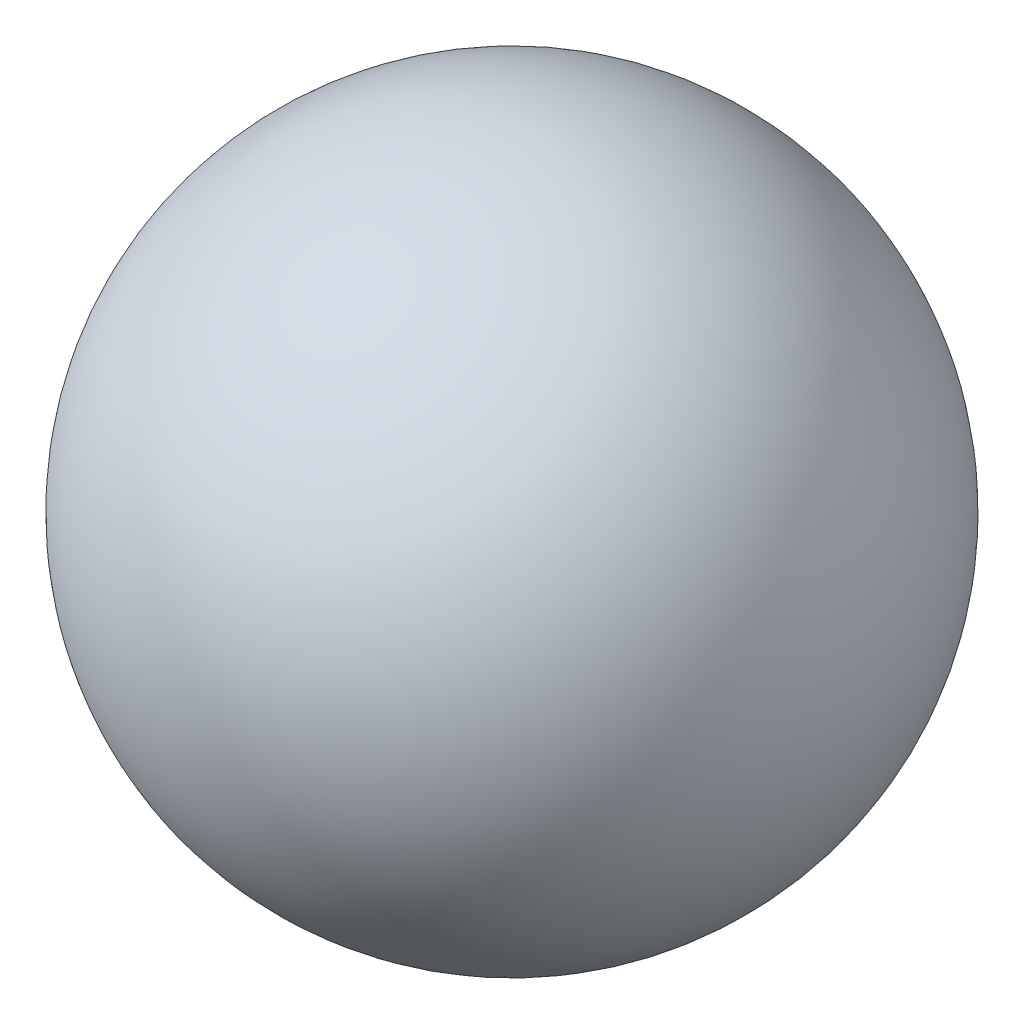
ISO-10303-21;
HEADER;
FILE_DESCRIPTION(('STEP AP214'),'2;1');
FILE_NAME('part.step','',(''),(''),'','','');
FILE_SCHEMA(('AUTOMOTIVE_DESIGN { 1 0 10303 214 1 1 1 1 }'));
ENDSEC;
DATA;
#1=APPLICATION_CONTEXT('core data for automotive mechanical design processes');
#2=APPLICATION_PROTOCOL_DEFINITION('international standard','automotive_design',2000,#1);
#3=PRODUCT_CONTEXT('',#1,'mechanical');
#4=PRODUCT('Part','Part','',(#3));
#5=PRODUCT_RELATED_PRODUCT_CATEGORY('part','',(#4));
#6=PRODUCT_DEFINITION_FORMATION('','',#4);
#7=PRODUCT_DEFINITION_CONTEXT('part definition',#1,'design');
#8=PRODUCT_DEFINITION('design','',#6,#7);
#9=PRODUCT_DEFINITION_SHAPE('','',#8);
#10=(LENGTH_UNIT() NAMED_UNIT(*) SI_UNIT(.MILLI.,.METRE.));
#11=(NAMED_UNIT(*) PLANE_ANGLE_UNIT() SI_UNIT($,.RADIAN.));
#12=(NAMED_UNIT(*) SI_UNIT($,.STERADIAN.) SOLID_ANGLE_UNIT());
#13=UNCERTAINTY_MEASURE_WITH_UNIT(LENGTH_MEASURE(1.E-05),#10,'distance_accuracy_value','');
#14=(GEOMETRIC_REPRESENTATION_CONTEXT(3) GLOBAL_UNCERTAINTY_ASSIGNED_CONTEXT((#13)) GLOBAL_UNIT_ASSIGNED_CONTEXT((#10,
#11,#12)) REPRESENTATION_CONTEXT('',''));
#15=CARTESIAN_POINT('',(0.,0.,0.));
#16=DIRECTION('',(0.,0.,1.));
#17=DIRECTION('',(1.,0.,0.));
#18=AXIS2_PLACEMENT_3D('',#15,#16,#17);
#19=CARTESIAN_POINT('',(0.,0.,0.));
#20=DIRECTION('',(0.,0.,-1.));
#21=DIRECTION('',(1.,0.,0.));
#22=AXIS2_PLACEMENT_3D('',#19,#20,#21);
#23=SPHERICAL_SURFACE('',#22,25.4);
#24=CARTESIAN_POINT('',(0.,0.,-25.4));
#25=VERTEX_POINT('',#24);
#26=VERTEX_LOOP('',#25);
#27=FACE_BOUND('',#26,.T.);
#28=ADVANCED_FACE('F31',(#27),#23,.T.);
#29=CLOSED_SHELL('',(#28));
#30=MANIFOLD_SOLID_BREP('B2',#29);
#31=ADVANCED_BREP_SHAPE_REPRESENTATION('',(#18,#30),#14);
#32=SHAPE_DEFINITION_REPRESENTATION(#9,#31);
ENDSEC;
END-ISO-10303-21;
